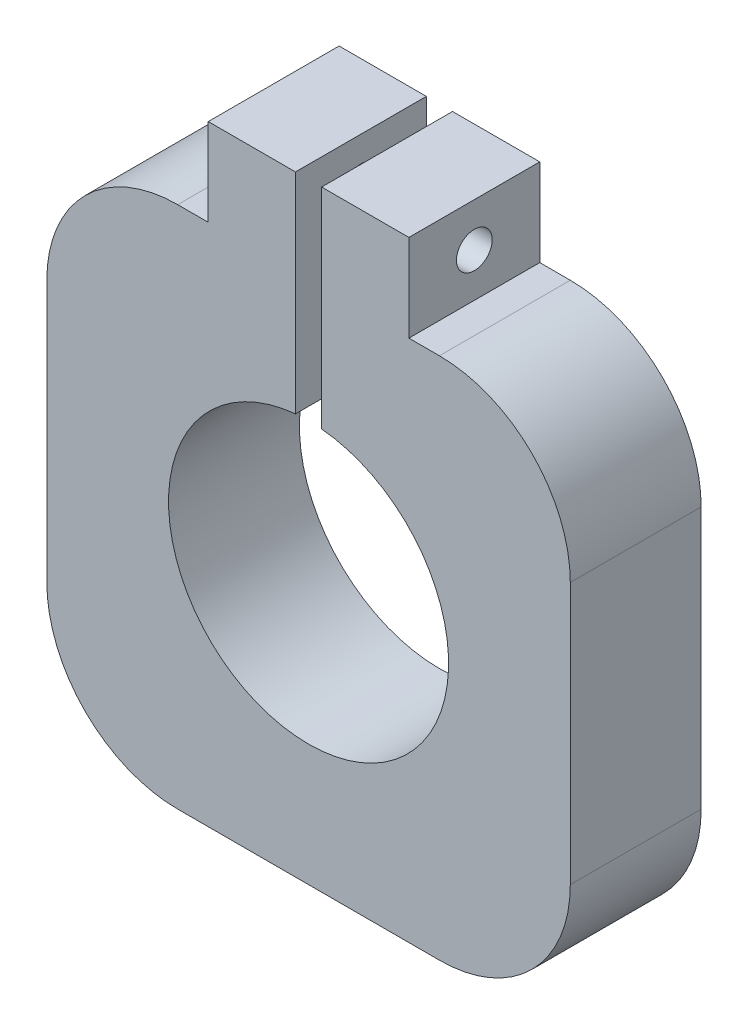
ISO-10303-21;
HEADER;
FILE_DESCRIPTION(('STEP AP214'),'2;1');
FILE_NAME('part.step','',(''),(''),'','','');
FILE_SCHEMA(('AUTOMOTIVE_DESIGN { 1 0 10303 214 1 1 1 1 }'));
ENDSEC;
DATA;
#1=APPLICATION_CONTEXT('core data for automotive mechanical design processes');
#2=APPLICATION_PROTOCOL_DEFINITION('international standard','automotive_design',2000,#1);
#3=PRODUCT_CONTEXT('',#1,'mechanical');
#4=PRODUCT('Part','Part','',(#3));
#5=PRODUCT_RELATED_PRODUCT_CATEGORY('part','',(#4));
#6=PRODUCT_DEFINITION_FORMATION('','',#4);
#7=PRODUCT_DEFINITION_CONTEXT('part definition',#1,'design');
#8=PRODUCT_DEFINITION('design','',#6,#7);
#9=PRODUCT_DEFINITION_SHAPE('','',#8);
#10=(LENGTH_UNIT() NAMED_UNIT(*) SI_UNIT(.MILLI.,.METRE.));
#11=(NAMED_UNIT(*) PLANE_ANGLE_UNIT() SI_UNIT($,.RADIAN.));
#12=(NAMED_UNIT(*) SI_UNIT($,.STERADIAN.) SOLID_ANGLE_UNIT());
#13=UNCERTAINTY_MEASURE_WITH_UNIT(LENGTH_MEASURE(1.E-05),#10,'distance_accuracy_value','');
#14=(GEOMETRIC_REPRESENTATION_CONTEXT(3) GLOBAL_UNCERTAINTY_ASSIGNED_CONTEXT((#13)) GLOBAL_UNIT_ASSIGNED_CONTEXT((#10,
#11,#12)) REPRESENTATION_CONTEXT('',''));
#15=CARTESIAN_POINT('',(0.,0.,0.));
#16=DIRECTION('',(0.,0.,1.));
#17=DIRECTION('',(1.,0.,0.));
#18=AXIS2_PLACEMENT_3D('',#15,#16,#17);
#19=CARTESIAN_POINT('',(15.,-15.,15.));
#20=DIRECTION('',(0.,0.,-1.));
#21=DIRECTION('',(-1.,0.,0.));
#22=AXIS2_PLACEMENT_3D('',#19,#20,#21);
#23=CYLINDRICAL_SURFACE('',#22,15.);
#24=DIRECTION('',(0.,0.,-1.));
#25=VECTOR('',#24,1.);
#26=CARTESIAN_POINT('',(30.,-15.,15.));
#27=LINE('',#26,#25);
#28=CARTESIAN_POINT('',(30.,-15.,15.));
#29=VERTEX_POINT('',#28);
#30=CARTESIAN_POINT('',(30.,-15.,0.));
#31=VERTEX_POINT('',#30);
#32=EDGE_CURVE('E307',#29,#31,#27,.T.);
#33=ORIENTED_EDGE('',*,*,#32,.F.);
#34=CARTESIAN_POINT('',(15.,-15.,15.));
#35=DIRECTION('',(0.,0.,1.));
#36=DIRECTION('',(1.,0.,0.));
#37=AXIS2_PLACEMENT_3D('',#34,#35,#36);
#38=CIRCLE('',#37,15.);
#39=CARTESIAN_POINT('',(15.,-30.,15.));
#40=VERTEX_POINT('',#39);
#41=EDGE_CURVE('E47',#40,#29,#38,.T.);
#42=ORIENTED_EDGE('',*,*,#41,.F.);
#43=DIRECTION('',(0.,0.,-1.));
#44=VECTOR('',#43,1.);
#45=CARTESIAN_POINT('',(15.,-30.,15.));
#46=LINE('',#45,#44);
#47=CARTESIAN_POINT('',(15.,-30.,0.));
#48=VERTEX_POINT('',#47);
#49=EDGE_CURVE('E311',#48,#40,#46,.F.);
#50=ORIENTED_EDGE('',*,*,#49,.F.);
#51=CARTESIAN_POINT('',(15.,-15.,0.));
#52=DIRECTION('',(0.,0.,1.));
#53=DIRECTION('',(1.,0.,0.));
#54=AXIS2_PLACEMENT_3D('',#51,#52,#53);
#55=CIRCLE('',#54,15.);
#56=EDGE_CURVE('E11',#31,#48,#55,.F.);
#57=ORIENTED_EDGE('',*,*,#56,.F.);
#58=EDGE_LOOP('',(#33,#42,#50,#57));
#59=FACE_BOUND('',#58,.T.);
#60=ADVANCED_FACE('F39',(#59),#23,.T.);
#61=CARTESIAN_POINT('',(-15.,-15.,15.));
#62=DIRECTION('',(0.,0.,1.));
#63=DIRECTION('',(1.,0.,0.));
#64=AXIS2_PLACEMENT_3D('',#61,#62,#63);
#65=CYLINDRICAL_SURFACE('',#64,15.);
#66=DIRECTION('',(0.,0.,1.));
#67=VECTOR('',#66,1.);
#68=CARTESIAN_POINT('',(-30.,-15.,15.));
#69=LINE('',#68,#67);
#70=CARTESIAN_POINT('',(-30.,-15.,0.));
#71=VERTEX_POINT('',#70);
#72=CARTESIAN_POINT('',(-30.,-15.,15.));
#73=VERTEX_POINT('',#72);
#74=EDGE_CURVE('E293',#71,#73,#69,.T.);
#75=ORIENTED_EDGE('',*,*,#74,.F.);
#76=CARTESIAN_POINT('',(-15.,-15.,0.));
#77=DIRECTION('',(0.,0.,1.));
#78=DIRECTION('',(1.,0.,0.));
#79=AXIS2_PLACEMENT_3D('',#76,#77,#78);
#80=CIRCLE('',#79,15.);
#81=CARTESIAN_POINT('',(-15.,-30.,0.));
#82=VERTEX_POINT('',#81);
#83=EDGE_CURVE('E301',#82,#71,#80,.F.);
#84=ORIENTED_EDGE('',*,*,#83,.F.);
#85=DIRECTION('',(0.,0.,1.));
#86=VECTOR('',#85,1.);
#87=CARTESIAN_POINT('',(-15.,-30.,15.));
#88=LINE('',#87,#86);
#89=CARTESIAN_POINT('',(-15.,-30.,15.));
#90=VERTEX_POINT('',#89);
#91=EDGE_CURVE('E297',#90,#82,#88,.F.);
#92=ORIENTED_EDGE('',*,*,#91,.F.);
#93=CARTESIAN_POINT('',(-15.,-15.,15.));
#94=DIRECTION('',(0.,0.,1.));
#95=DIRECTION('',(1.,0.,0.));
#96=AXIS2_PLACEMENT_3D('',#93,#94,#95);
#97=CIRCLE('',#96,15.);
#98=EDGE_CURVE('E304',#73,#90,#97,.T.);
#99=ORIENTED_EDGE('',*,*,#98,.F.);
#100=EDGE_LOOP('',(#75,#84,#92,#99));
#101=FACE_BOUND('',#100,.T.);
#102=ADVANCED_FACE('F362',(#101),#65,.T.);
#103=CARTESIAN_POINT('',(-15.,15.,15.));
#104=DIRECTION('',(0.,0.,1.));
#105=DIRECTION('',(1.,0.,0.));
#106=AXIS2_PLACEMENT_3D('',#103,#104,#105);
#107=CYLINDRICAL_SURFACE('',#106,15.);
#108=DIRECTION('',(0.,0.,1.));
#109=VECTOR('',#108,1.);
#110=CARTESIAN_POINT('',(-15.,30.,15.));
#111=LINE('',#110,#109);
#112=CARTESIAN_POINT('',(-15.,30.,0.));
#113=VERTEX_POINT('',#112);
#114=CARTESIAN_POINT('',(-15.,30.,15.));
#115=VERTEX_POINT('',#114);
#116=EDGE_CURVE('E279',#113,#115,#111,.T.);
#117=ORIENTED_EDGE('',*,*,#116,.F.);
#118=CARTESIAN_POINT('',(-15.,15.,0.));
#119=DIRECTION('',(0.,0.,1.));
#120=DIRECTION('',(1.,0.,0.));
#121=AXIS2_PLACEMENT_3D('',#118,#119,#120);
#122=CIRCLE('',#121,15.);
#123=CARTESIAN_POINT('',(-30.,15.,0.));
#124=VERTEX_POINT('',#123);
#125=EDGE_CURVE('E287',#124,#113,#122,.F.);
#126=ORIENTED_EDGE('',*,*,#125,.F.);
#127=DIRECTION('',(0.,0.,1.));
#128=VECTOR('',#127,1.);
#129=CARTESIAN_POINT('',(-30.,15.,15.));
#130=LINE('',#129,#128);
#131=CARTESIAN_POINT('',(-30.,15.,15.));
#132=VERTEX_POINT('',#131);
#133=EDGE_CURVE('E283',#132,#124,#130,.F.);
#134=ORIENTED_EDGE('',*,*,#133,.F.);
#135=CARTESIAN_POINT('',(-15.,15.,15.));
#136=DIRECTION('',(0.,0.,1.));
#137=DIRECTION('',(1.,0.,0.));
#138=AXIS2_PLACEMENT_3D('',#135,#136,#137);
#139=CIRCLE('',#138,15.);
#140=EDGE_CURVE('E290',#115,#132,#139,.T.);
#141=ORIENTED_EDGE('',*,*,#140,.F.);
#142=EDGE_LOOP('',(#117,#126,#134,#141));
#143=FACE_BOUND('',#142,.T.);
#144=ADVANCED_FACE('F366',(#143),#107,.T.);
#145=CARTESIAN_POINT('',(15.,15.,15.));
#146=DIRECTION('',(0.,0.,1.));
#147=DIRECTION('',(1.,0.,0.));
#148=AXIS2_PLACEMENT_3D('',#145,#146,#147);
#149=CYLINDRICAL_SURFACE('',#148,15.);
#150=DIRECTION('',(0.,0.,1.));
#151=VECTOR('',#150,1.);
#152=CARTESIAN_POINT('',(30.,15.,15.));
#153=LINE('',#152,#151);
#154=CARTESIAN_POINT('',(30.,15.,0.));
#155=VERTEX_POINT('',#154);
#156=CARTESIAN_POINT('',(30.,15.,15.));
#157=VERTEX_POINT('',#156);
#158=EDGE_CURVE('E172',#155,#157,#153,.T.);
#159=ORIENTED_EDGE('',*,*,#158,.F.);
#160=CARTESIAN_POINT('',(15.,15.,0.));
#161=DIRECTION('',(0.,0.,1.));
#162=DIRECTION('',(1.,0.,0.));
#163=AXIS2_PLACEMENT_3D('',#160,#161,#162);
#164=CIRCLE('',#163,15.);
#165=CARTESIAN_POINT('',(15.,30.,0.));
#166=VERTEX_POINT('',#165);
#167=EDGE_CURVE('E273',#166,#155,#164,.F.);
#168=ORIENTED_EDGE('',*,*,#167,.F.);
#169=DIRECTION('',(0.,0.,1.));
#170=VECTOR('',#169,1.);
#171=CARTESIAN_POINT('',(15.,30.,15.));
#172=LINE('',#171,#170);
#173=CARTESIAN_POINT('',(15.,30.,15.));
#174=VERTEX_POINT('',#173);
#175=EDGE_CURVE('E270',#174,#166,#172,.F.);
#176=ORIENTED_EDGE('',*,*,#175,.F.);
#177=CARTESIAN_POINT('',(15.,15.,15.));
#178=DIRECTION('',(0.,0.,1.));
#179=DIRECTION('',(1.,0.,0.));
#180=AXIS2_PLACEMENT_3D('',#177,#178,#179);
#181=CIRCLE('',#180,15.);
#182=EDGE_CURVE('E157',#157,#174,#181,.T.);
#183=ORIENTED_EDGE('',*,*,#182,.F.);
#184=EDGE_LOOP('',(#159,#168,#176,#183));
#185=FACE_BOUND('',#184,.T.);
#186=ADVANCED_FACE('F371',(#185),#149,.T.);
#187=CARTESIAN_POINT('',(-11.5,30.,15.));
#188=DIRECTION('',(0.,-1.,0.));
#189=DIRECTION('',(1.,0.,0.));
#190=AXIS2_PLACEMENT_3D('',#187,#188,#189);
#191=PLANE('',#190);
#192=DIRECTION('',(-1.,0.,0.));
#193=VECTOR('',#192,1.);
#194=CARTESIAN_POINT('',(-11.5,30.,0.));
#195=LINE('',#194,#193);
#196=CARTESIAN_POINT('',(-11.5,30.,0.));
#197=VERTEX_POINT('',#196);
#198=EDGE_CURVE('E201',#197,#113,#195,.T.);
#199=ORIENTED_EDGE('',*,*,#198,.T.);
#200=ORIENTED_EDGE('',*,*,#116,.T.);
#201=DIRECTION('',(-1.,0.,0.));
#202=VECTOR('',#201,1.);
#203=CARTESIAN_POINT('',(-11.5,30.,15.));
#204=LINE('',#203,#202);
#205=CARTESIAN_POINT('',(-11.5,30.,15.));
#206=VERTEX_POINT('',#205);
#207=EDGE_CURVE('E241',#206,#115,#204,.T.);
#208=ORIENTED_EDGE('',*,*,#207,.F.);
#209=DIRECTION('',(0.,0.,-1.));
#210=VECTOR('',#209,1.);
#211=CARTESIAN_POINT('',(-11.5,30.,15.));
#212=LINE('',#211,#210);
#213=EDGE_CURVE('E200',#206,#197,#212,.T.);
#214=ORIENTED_EDGE('',*,*,#213,.T.);
#215=EDGE_LOOP('',(#199,#200,#208,#214));
#216=FACE_BOUND('',#215,.T.);
#217=ADVANCED_FACE('F378',(#216),#191,.F.);
#218=CARTESIAN_POINT('',(-30.,-30.,15.));
#219=DIRECTION('',(1.,0.,0.));
#220=DIRECTION('',(0.,0.,-1.));
#221=AXIS2_PLACEMENT_3D('',#218,#219,#220);
#222=PLANE('',#221);
#223=DIRECTION('',(0.,-1.,0.));
#224=VECTOR('',#223,1.);
#225=CARTESIAN_POINT('',(-30.,-30.,0.));
#226=LINE('',#225,#224);
#227=EDGE_CURVE('E205',#124,#71,#226,.T.);
#228=ORIENTED_EDGE('',*,*,#227,.T.);
#229=ORIENTED_EDGE('',*,*,#74,.T.);
#230=DIRECTION('',(0.,-1.,0.));
#231=VECTOR('',#230,1.);
#232=CARTESIAN_POINT('',(-30.,-30.,15.));
#233=LINE('',#232,#231);
#234=EDGE_CURVE('E322',#132,#73,#233,.T.);
#235=ORIENTED_EDGE('',*,*,#234,.F.);
#236=ORIENTED_EDGE('',*,*,#133,.T.);
#237=EDGE_LOOP('',(#228,#229,#235,#236));
#238=FACE_BOUND('',#237,.T.);
#239=ADVANCED_FACE('F382',(#238),#222,.F.);
#240=CARTESIAN_POINT('',(30.,-30.,15.));
#241=DIRECTION('',(0.,1.,0.));
#242=DIRECTION('',(-1.,0.,0.));
#243=AXIS2_PLACEMENT_3D('',#240,#241,#242);
#244=PLANE('',#243);
#245=DIRECTION('',(1.,0.,0.));
#246=VECTOR('',#245,1.);
#247=CARTESIAN_POINT('',(30.,-30.,0.));
#248=LINE('',#247,#246);
#249=EDGE_CURVE('E210',#82,#48,#248,.T.);
#250=ORIENTED_EDGE('',*,*,#249,.T.);
#251=ORIENTED_EDGE('',*,*,#49,.T.);
#252=DIRECTION('',(1.,0.,0.));
#253=VECTOR('',#252,1.);
#254=CARTESIAN_POINT('',(30.,-30.,15.));
#255=LINE('',#254,#253);
#256=EDGE_CURVE('E316',#90,#40,#255,.T.);
#257=ORIENTED_EDGE('',*,*,#256,.F.);
#258=ORIENTED_EDGE('',*,*,#91,.T.);
#259=EDGE_LOOP('',(#250,#251,#257,#258));
#260=FACE_BOUND('',#259,.T.);
#261=ADVANCED_FACE('F386',(#260),#244,.F.);
#262=CARTESIAN_POINT('',(30.,-30.,15.));
#263=DIRECTION('',(-1.,0.,0.));
#264=DIRECTION('',(0.,-1.,0.));
#265=AXIS2_PLACEMENT_3D('',#262,#263,#264);
#266=PLANE('',#265);
#267=DIRECTION('',(0.,1.,0.));
#268=VECTOR('',#267,1.);
#269=CARTESIAN_POINT('',(30.,-30.,15.));
#270=LINE('',#269,#268);
#271=EDGE_CURVE('E162',#29,#157,#270,.T.);
#272=ORIENTED_EDGE('',*,*,#271,.F.);
#273=ORIENTED_EDGE('',*,*,#32,.T.);
#274=DIRECTION('',(0.,1.,0.));
#275=VECTOR('',#274,1.);
#276=CARTESIAN_POINT('',(30.,-30.,0.));
#277=LINE('',#276,#275);
#278=EDGE_CURVE('E214',#31,#155,#277,.T.);
#279=ORIENTED_EDGE('',*,*,#278,.T.);
#280=ORIENTED_EDGE('',*,*,#158,.T.);
#281=EDGE_LOOP('',(#272,#273,#279,#280));
#282=FACE_BOUND('',#281,.T.);
#283=ADVANCED_FACE('F318',(#282),#266,.F.);
#284=CARTESIAN_POINT('',(30.,30.,15.));
#285=DIRECTION('',(0.,-1.,0.));
#286=DIRECTION('',(1.,0.,0.));
#287=AXIS2_PLACEMENT_3D('',#284,#285,#286);
#288=PLANE('',#287);
#289=DIRECTION('',(-1.,0.,0.));
#290=VECTOR('',#289,1.);
#291=CARTESIAN_POINT('',(30.,30.,15.));
#292=LINE('',#291,#290);
#293=CARTESIAN_POINT('',(11.5,30.,15.));
#294=VERTEX_POINT('',#293);
#295=EDGE_CURVE('E149',#174,#294,#292,.T.);
#296=ORIENTED_EDGE('',*,*,#295,.F.);
#297=ORIENTED_EDGE('',*,*,#175,.T.);
#298=DIRECTION('',(-1.,0.,0.));
#299=VECTOR('',#298,1.);
#300=CARTESIAN_POINT('',(30.,30.,0.));
#301=LINE('',#300,#299);
#302=CARTESIAN_POINT('',(11.5,30.,0.));
#303=VERTEX_POINT('',#302);
#304=EDGE_CURVE('E168',#166,#303,#301,.T.);
#305=ORIENTED_EDGE('',*,*,#304,.T.);
#306=DIRECTION('',(0.,0.,-1.));
#307=VECTOR('',#306,1.);
#308=CARTESIAN_POINT('',(11.5,30.,15.));
#309=LINE('',#308,#307);
#310=EDGE_CURVE('E165',#294,#303,#309,.T.);
#311=ORIENTED_EDGE('',*,*,#310,.F.);
#312=EDGE_LOOP('',(#296,#297,#305,#311));
#313=FACE_BOUND('',#312,.T.);
#314=ADVANCED_FACE('F166',(#313),#288,.F.);
#315=CARTESIAN_POINT('',(11.5,30.,15.));
#316=DIRECTION('',(-1.,0.,0.));
#317=DIRECTION('',(0.,0.,1.));
#318=AXIS2_PLACEMENT_3D('',#315,#316,#317);
#319=PLANE('',#318);
#320=CARTESIAN_POINT('',(11.5,35.,7.5));
#321=DIRECTION('',(1.,0.,0.));
#322=DIRECTION('',(0.,0.,-1.));
#323=AXIS2_PLACEMENT_3D('',#320,#321,#322);
#324=CIRCLE('',#323,2.05);
#325=CARTESIAN_POINT('',(11.5,35.,5.45));
#326=VERTEX_POINT('',#325);
#327=EDGE_CURVE('E342',#326,#326,#324,.T.);
#328=ORIENTED_EDGE('',*,*,#327,.F.);
#329=EDGE_LOOP('',(#328));
#330=FACE_BOUND('',#329,.T.);
#331=DIRECTION('',(0.,1.,0.));
#332=VECTOR('',#331,1.);
#333=CARTESIAN_POINT('',(11.5,30.,0.));
#334=LINE('',#333,#332);
#335=CARTESIAN_POINT('',(11.5,40.,0.));
#336=VERTEX_POINT('',#335);
#337=EDGE_CURVE('E219',#303,#336,#334,.T.);
#338=ORIENTED_EDGE('',*,*,#337,.T.);
#339=DIRECTION('',(0.,0.,-1.));
#340=VECTOR('',#339,1.);
#341=CARTESIAN_POINT('',(11.5,40.,15.));
#342=LINE('',#341,#340);
#343=CARTESIAN_POINT('',(11.5,40.,15.));
#344=VERTEX_POINT('',#343);
#345=EDGE_CURVE('E173',#344,#336,#342,.T.);
#346=ORIENTED_EDGE('',*,*,#345,.F.);
#347=DIRECTION('',(0.,1.,0.));
#348=VECTOR('',#347,1.);
#349=CARTESIAN_POINT('',(11.5,30.,15.));
#350=LINE('',#349,#348);
#351=EDGE_CURVE('E154',#294,#344,#350,.T.);
#352=ORIENTED_EDGE('',*,*,#351,.F.);
#353=ORIENTED_EDGE('',*,*,#310,.T.);
#354=EDGE_LOOP('',(#338,#346,#352,#353));
#355=FACE_BOUND('',#354,.T.);
#356=ADVANCED_FACE('F175',(#330,#355),#319,.F.);
#357=CARTESIAN_POINT('',(1.5,40.,15.));
#358=DIRECTION('',(0.,-1.,0.));
#359=DIRECTION('',(0.,0.,-1.));
#360=AXIS2_PLACEMENT_3D('',#357,#358,#359);
#361=PLANE('',#360);
#362=DIRECTION('',(-1.,0.,0.));
#363=VECTOR('',#362,1.);
#364=CARTESIAN_POINT('',(1.5,40.,0.));
#365=LINE('',#364,#363);
#366=CARTESIAN_POINT('',(1.5,40.,0.));
#367=VERTEX_POINT('',#366);
#368=EDGE_CURVE('E222',#336,#367,#365,.T.);
#369=ORIENTED_EDGE('',*,*,#368,.T.);
#370=DIRECTION('',(0.,0.,-1.));
#371=VECTOR('',#370,1.);
#372=CARTESIAN_POINT('',(1.5,40.,15.));
#373=LINE('',#372,#371);
#374=CARTESIAN_POINT('',(1.5,40.,15.));
#375=VERTEX_POINT('',#374);
#376=EDGE_CURVE('E261',#375,#367,#373,.T.);
#377=ORIENTED_EDGE('',*,*,#376,.F.);
#378=DIRECTION('',(-1.,0.,0.));
#379=VECTOR('',#378,1.);
#380=CARTESIAN_POINT('',(1.5,40.,15.));
#381=LINE('',#380,#379);
#382=EDGE_CURVE('E179',#344,#375,#381,.T.);
#383=ORIENTED_EDGE('',*,*,#382,.F.);
#384=ORIENTED_EDGE('',*,*,#345,.T.);
#385=EDGE_LOOP('',(#369,#377,#383,#384));
#386=FACE_BOUND('',#385,.T.);
#387=ADVANCED_FACE('F351',(#386),#361,.F.);
#388=CARTESIAN_POINT('',(1.5,30.,15.));
#389=DIRECTION('',(1.,0.,0.));
#390=DIRECTION('',(0.,1.,0.));
#391=AXIS2_PLACEMENT_3D('',#388,#389,#390);
#392=PLANE('',#391);
#393=CARTESIAN_POINT('',(1.5,35.,7.5));
#394=DIRECTION('',(1.,0.,0.));
#395=DIRECTION('',(0.,1.,0.));
#396=AXIS2_PLACEMENT_3D('',#393,#394,#395);
#397=CIRCLE('',#396,2.05);
#398=CARTESIAN_POINT('',(1.5,37.05,7.5));
#399=VERTEX_POINT('',#398);
#400=EDGE_CURVE('E206',#399,#399,#397,.T.);
#401=ORIENTED_EDGE('',*,*,#400,.T.);
#402=EDGE_LOOP('',(#401));
#403=FACE_BOUND('',#402,.T.);
#404=DIRECTION('',(0.,-1.,0.));
#405=VECTOR('',#404,1.);
#406=CARTESIAN_POINT('',(1.5,30.,0.));
#407=LINE('',#406,#405);
#408=CARTESIAN_POINT('',(1.5,15.9797528141082,0.));
#409=VERTEX_POINT('',#408);
#410=EDGE_CURVE('E226',#367,#409,#407,.T.);
#411=ORIENTED_EDGE('',*,*,#410,.T.);
#412=DIRECTION('',(0.,0.,-1.));
#413=VECTOR('',#412,1.);
#414=CARTESIAN_POINT('',(1.5,15.9797528141082,15.));
#415=LINE('',#414,#413);
#416=CARTESIAN_POINT('',(1.5,15.9797528141082,15.));
#417=VERTEX_POINT('',#416);
#418=EDGE_CURVE('E257',#417,#409,#415,.T.);
#419=ORIENTED_EDGE('',*,*,#418,.F.);
#420=DIRECTION('',(0.,-1.,0.));
#421=VECTOR('',#420,1.);
#422=CARTESIAN_POINT('',(1.5,30.,15.));
#423=LINE('',#422,#421);
#424=EDGE_CURVE('E182',#375,#417,#423,.T.);
#425=ORIENTED_EDGE('',*,*,#424,.F.);
#426=ORIENTED_EDGE('',*,*,#376,.T.);
#427=EDGE_LOOP('',(#411,#419,#425,#426));
#428=FACE_BOUND('',#427,.T.);
#429=ADVANCED_FACE('F357',(#403,#428),#392,.F.);
#430=CARTESIAN_POINT('',(0.,0.,15.));
#431=DIRECTION('',(0.,0.,-1.));
#432=DIRECTION('',(-1.,0.,0.));
#433=AXIS2_PLACEMENT_3D('',#430,#431,#432);
#434=CYLINDRICAL_SURFACE('',#433,16.05);
#435=CARTESIAN_POINT('',(0.,0.,0.));
#436=DIRECTION('',(0.,0.,-1.));
#437=DIRECTION('',(1.,0.,0.));
#438=AXIS2_PLACEMENT_3D('',#435,#436,#437);
#439=CIRCLE('',#438,16.05);
#440=CARTESIAN_POINT('',(-1.49999999999999,15.9797528141082,0.));
#441=VERTEX_POINT('',#440);
#442=EDGE_CURVE('E229',#409,#441,#439,.T.);
#443=ORIENTED_EDGE('',*,*,#442,.T.);
#444=DIRECTION('',(0.,0.,-1.));
#445=VECTOR('',#444,1.);
#446=CARTESIAN_POINT('',(-1.49999999999999,15.9797528141082,15.));
#447=LINE('',#446,#445);
#448=CARTESIAN_POINT('',(-1.49999999999999,15.9797528141082,15.));
#449=VERTEX_POINT('',#448);
#450=EDGE_CURVE('E253',#449,#441,#447,.T.);
#451=ORIENTED_EDGE('',*,*,#450,.F.);
#452=CARTESIAN_POINT('',(0.,0.,15.));
#453=DIRECTION('',(0.,0.,-1.));
#454=DIRECTION('',(1.,0.,0.));
#455=AXIS2_PLACEMENT_3D('',#452,#453,#454);
#456=CIRCLE('',#455,16.05);
#457=EDGE_CURVE('E188',#417,#449,#456,.T.);
#458=ORIENTED_EDGE('',*,*,#457,.F.);
#459=ORIENTED_EDGE('',*,*,#418,.T.);
#460=EDGE_LOOP('',(#443,#451,#458,#459));
#461=FACE_BOUND('',#460,.T.);
#462=ADVANCED_FACE('F492',(#461),#434,.F.);
#463=CARTESIAN_POINT('',(-1.5,40.,15.));
#464=DIRECTION('',(-1.,0.,0.));
#465=DIRECTION('',(0.,-1.,0.));
#466=AXIS2_PLACEMENT_3D('',#463,#464,#465);
#467=PLANE('',#466);
#468=CARTESIAN_POINT('',(-1.5,35.,7.5));
#469=DIRECTION('',(-1.,0.,0.));
#470=DIRECTION('',(0.,-1.,0.));
#471=AXIS2_PLACEMENT_3D('',#468,#469,#470);
#472=CIRCLE('',#471,2.05);
#473=CARTESIAN_POINT('',(-1.5,32.95,7.5));
#474=VERTEX_POINT('',#473);
#475=EDGE_CURVE('E334',#474,#474,#472,.T.);
#476=ORIENTED_EDGE('',*,*,#475,.T.);
#477=EDGE_LOOP('',(#476));
#478=FACE_BOUND('',#477,.T.);
#479=DIRECTION('',(0.,1.,0.));
#480=VECTOR('',#479,1.);
#481=CARTESIAN_POINT('',(-1.5,40.,0.));
#482=LINE('',#481,#480);
#483=CARTESIAN_POINT('',(-1.5,40.,0.));
#484=VERTEX_POINT('',#483);
#485=EDGE_CURVE('E232',#441,#484,#482,.T.);
#486=ORIENTED_EDGE('',*,*,#485,.T.);
#487=DIRECTION('',(0.,0.,-1.));
#488=VECTOR('',#487,1.);
#489=CARTESIAN_POINT('',(-1.5,40.,15.));
#490=LINE('',#489,#488);
#491=CARTESIAN_POINT('',(-1.5,40.,15.));
#492=VERTEX_POINT('',#491);
#493=EDGE_CURVE('E249',#492,#484,#490,.T.);
#494=ORIENTED_EDGE('',*,*,#493,.F.);
#495=DIRECTION('',(0.,1.,0.));
#496=VECTOR('',#495,1.);
#497=CARTESIAN_POINT('',(-1.5,40.,15.));
#498=LINE('',#497,#496);
#499=EDGE_CURVE('E191',#449,#492,#498,.T.);
#500=ORIENTED_EDGE('',*,*,#499,.F.);
#501=ORIENTED_EDGE('',*,*,#450,.T.);
#502=EDGE_LOOP('',(#486,#494,#500,#501));
#503=FACE_BOUND('',#502,.T.);
#504=ADVANCED_FACE('F484',(#478,#503),#467,.F.);
#505=CARTESIAN_POINT('',(-1.5,40.,15.));
#506=DIRECTION('',(0.,-1.,0.));
#507=DIRECTION('',(0.,0.,-1.));
#508=AXIS2_PLACEMENT_3D('',#505,#506,#507);
#509=PLANE('',#508);
#510=DIRECTION('',(-1.,0.,0.));
#511=VECTOR('',#510,1.);
#512=CARTESIAN_POINT('',(-1.5,40.,0.));
#513=LINE('',#512,#511);
#514=CARTESIAN_POINT('',(-11.5,40.,0.));
#515=VERTEX_POINT('',#514);
#516=EDGE_CURVE('E235',#484,#515,#513,.T.);
#517=ORIENTED_EDGE('',*,*,#516,.T.);
#518=DIRECTION('',(0.,0.,-1.));
#519=VECTOR('',#518,1.);
#520=CARTESIAN_POINT('',(-11.5,40.,15.));
#521=LINE('',#520,#519);
#522=CARTESIAN_POINT('',(-11.5,40.,15.));
#523=VERTEX_POINT('',#522);
#524=EDGE_CURVE('E245',#523,#515,#521,.T.);
#525=ORIENTED_EDGE('',*,*,#524,.F.);
#526=DIRECTION('',(-1.,0.,0.));
#527=VECTOR('',#526,1.);
#528=CARTESIAN_POINT('',(-1.5,40.,15.));
#529=LINE('',#528,#527);
#530=EDGE_CURVE('E194',#492,#523,#529,.T.);
#531=ORIENTED_EDGE('',*,*,#530,.F.);
#532=ORIENTED_EDGE('',*,*,#493,.T.);
#533=EDGE_LOOP('',(#517,#525,#531,#532));
#534=FACE_BOUND('',#533,.T.);
#535=ADVANCED_FACE('F476',(#534),#509,.F.);
#536=CARTESIAN_POINT('',(-11.5,30.,15.));
#537=DIRECTION('',(1.,0.,0.));
#538=DIRECTION('',(0.,0.,-1.));
#539=AXIS2_PLACEMENT_3D('',#536,#537,#538);
#540=PLANE('',#539);
#541=CARTESIAN_POINT('',(-11.5,35.,7.5));
#542=DIRECTION('',(1.,0.,0.));
#543=DIRECTION('',(0.,0.,-1.));
#544=AXIS2_PLACEMENT_3D('',#541,#542,#543);
#545=CIRCLE('',#544,2.05);
#546=CARTESIAN_POINT('',(-11.5,35.,5.45));
#547=VERTEX_POINT('',#546);
#548=EDGE_CURVE('E338',#547,#547,#545,.F.);
#549=ORIENTED_EDGE('',*,*,#548,.F.);
#550=EDGE_LOOP('',(#549));
#551=FACE_BOUND('',#550,.T.);
#552=DIRECTION('',(0.,-1.,0.));
#553=VECTOR('',#552,1.);
#554=CARTESIAN_POINT('',(-11.5,30.,0.));
#555=LINE('',#554,#553);
#556=EDGE_CURVE('E238',#515,#197,#555,.T.);
#557=ORIENTED_EDGE('',*,*,#556,.T.);
#558=ORIENTED_EDGE('',*,*,#213,.F.);
#559=DIRECTION('',(0.,-1.,0.));
#560=VECTOR('',#559,1.);
#561=CARTESIAN_POINT('',(-11.5,30.,15.));
#562=LINE('',#561,#560);
#563=EDGE_CURVE('E197',#523,#206,#562,.T.);
#564=ORIENTED_EDGE('',*,*,#563,.F.);
#565=ORIENTED_EDGE('',*,*,#524,.T.);
#566=EDGE_LOOP('',(#557,#558,#564,#565));
#567=FACE_BOUND('',#566,.T.);
#568=ADVANCED_FACE('F470',(#551,#567),#540,.F.);
#569=CARTESIAN_POINT('',(0.,0.,15.));
#570=DIRECTION('',(0.,0.,1.));
#571=DIRECTION('',(1.,0.,0.));
#572=AXIS2_PLACEMENT_3D('',#569,#570,#571);
#573=PLANE('',#572);
#574=ORIENTED_EDGE('',*,*,#256,.T.);
#575=ORIENTED_EDGE('',*,*,#41,.T.);
#576=ORIENTED_EDGE('',*,*,#271,.T.);
#577=ORIENTED_EDGE('',*,*,#182,.T.);
#578=ORIENTED_EDGE('',*,*,#295,.T.);
#579=ORIENTED_EDGE('',*,*,#351,.T.);
#580=ORIENTED_EDGE('',*,*,#382,.T.);
#581=ORIENTED_EDGE('',*,*,#424,.T.);
#582=ORIENTED_EDGE('',*,*,#457,.T.);
#583=ORIENTED_EDGE('',*,*,#499,.T.);
#584=ORIENTED_EDGE('',*,*,#530,.T.);
#585=ORIENTED_EDGE('',*,*,#563,.T.);
#586=ORIENTED_EDGE('',*,*,#207,.T.);
#587=ORIENTED_EDGE('',*,*,#140,.T.);
#588=ORIENTED_EDGE('',*,*,#234,.T.);
#589=ORIENTED_EDGE('',*,*,#98,.T.);
#590=EDGE_LOOP('',(#574,#575,#576,#577,#578,#579,#580,#581,#582,#583,#584,#585,#586,#587,#588,#589));
#591=FACE_BOUND('',#590,.T.);
#592=ADVANCED_FACE('F152',(#591),#573,.T.);
#593=CARTESIAN_POINT('',(0.,0.,0.));
#594=DIRECTION('',(0.,0.,1.));
#595=DIRECTION('',(1.,0.,0.));
#596=AXIS2_PLACEMENT_3D('',#593,#594,#595);
#597=PLANE('',#596);
#598=ORIENTED_EDGE('',*,*,#278,.F.);
#599=ORIENTED_EDGE('',*,*,#56,.T.);
#600=ORIENTED_EDGE('',*,*,#249,.F.);
#601=ORIENTED_EDGE('',*,*,#83,.T.);
#602=ORIENTED_EDGE('',*,*,#227,.F.);
#603=ORIENTED_EDGE('',*,*,#125,.T.);
#604=ORIENTED_EDGE('',*,*,#198,.F.);
#605=ORIENTED_EDGE('',*,*,#556,.F.);
#606=ORIENTED_EDGE('',*,*,#516,.F.);
#607=ORIENTED_EDGE('',*,*,#485,.F.);
#608=ORIENTED_EDGE('',*,*,#442,.F.);
#609=ORIENTED_EDGE('',*,*,#410,.F.);
#610=ORIENTED_EDGE('',*,*,#368,.F.);
#611=ORIENTED_EDGE('',*,*,#337,.F.);
#612=ORIENTED_EDGE('',*,*,#304,.F.);
#613=ORIENTED_EDGE('',*,*,#167,.T.);
#614=EDGE_LOOP('',(#598,#599,#600,#601,#602,#603,#604,#605,#606,#607,#608,#609,#610,#611,#612,#613));
#615=FACE_BOUND('',#614,.T.);
#616=ADVANCED_FACE('F449',(#615),#597,.F.);
#617=CARTESIAN_POINT('',(-17.2982756057297,35.,7.5));
#618=DIRECTION('',(1.,0.,0.));
#619=DIRECTION('',(0.,0.,-1.));
#620=AXIS2_PLACEMENT_3D('',#617,#618,#619);
#621=CYLINDRICAL_SURFACE('',#620,2.05);
#622=ORIENTED_EDGE('',*,*,#548,.T.);
#623=EDGE_LOOP('',(#622));
#624=FACE_BOUND('',#623,.T.);
#625=ORIENTED_EDGE('',*,*,#475,.F.);
#626=EDGE_LOOP('',(#625));
#627=FACE_BOUND('',#626,.T.);
#628=ADVANCED_FACE('F443',(#624,#627),#621,.F.);
#629=ORIENTED_EDGE('',*,*,#327,.T.);
#630=EDGE_LOOP('',(#629));
#631=FACE_BOUND('',#630,.T.);
#632=ORIENTED_EDGE('',*,*,#400,.F.);
#633=EDGE_LOOP('',(#632));
#634=FACE_BOUND('',#633,.T.);
#635=ADVANCED_FACE('F347',(#631,#634),#621,.F.);
#636=CLOSED_SHELL('',(#60,#102,#144,#186,#217,#239,#261,#283,#314,#356,#387,#429,#462,#504,#535,
#568,#592,#616,#628,#635));
#637=MANIFOLD_SOLID_BREP('B2',#636);
#638=ADVANCED_BREP_SHAPE_REPRESENTATION('',(#18,#637),#14);
#639=SHAPE_DEFINITION_REPRESENTATION(#9,#638);
ENDSEC;
END-ISO-10303-21;
